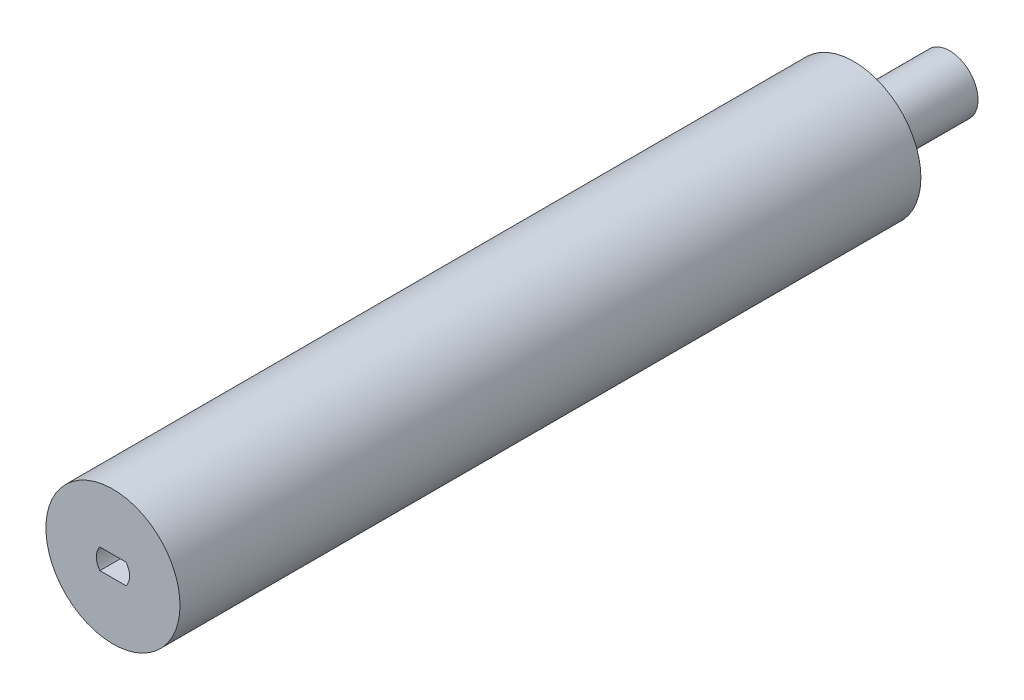
ISO-10303-21;
HEADER;
FILE_DESCRIPTION(('STEP AP214'),'2;1');
FILE_NAME('part.step','',(''),(''),'','','');
FILE_SCHEMA(('AUTOMOTIVE_DESIGN { 1 0 10303 214 1 1 1 1 }'));
ENDSEC;
DATA;
#1=APPLICATION_CONTEXT('core data for automotive mechanical design processes');
#2=APPLICATION_PROTOCOL_DEFINITION('international standard','automotive_design',2000,#1);
#3=PRODUCT_CONTEXT('',#1,'mechanical');
#4=PRODUCT('Part','Part','',(#3));
#5=PRODUCT_RELATED_PRODUCT_CATEGORY('part','',(#4));
#6=PRODUCT_DEFINITION_FORMATION('','',#4);
#7=PRODUCT_DEFINITION_CONTEXT('part definition',#1,'design');
#8=PRODUCT_DEFINITION('design','',#6,#7);
#9=PRODUCT_DEFINITION_SHAPE('','',#8);
#10=(LENGTH_UNIT() NAMED_UNIT(*) SI_UNIT(.MILLI.,.METRE.));
#11=(NAMED_UNIT(*) PLANE_ANGLE_UNIT() SI_UNIT($,.RADIAN.));
#12=(NAMED_UNIT(*) SI_UNIT($,.STERADIAN.) SOLID_ANGLE_UNIT());
#13=UNCERTAINTY_MEASURE_WITH_UNIT(LENGTH_MEASURE(1.E-05),#10,'distance_accuracy_value','');
#14=(GEOMETRIC_REPRESENTATION_CONTEXT(3) GLOBAL_UNCERTAINTY_ASSIGNED_CONTEXT((#13)) GLOBAL_UNIT_ASSIGNED_CONTEXT((#10,
#11,#12)) REPRESENTATION_CONTEXT('',''));
#15=CARTESIAN_POINT('',(0.,0.,0.));
#16=DIRECTION('',(0.,0.,1.));
#17=DIRECTION('',(1.,0.,0.));
#18=AXIS2_PLACEMENT_3D('',#15,#16,#17);
#19=CARTESIAN_POINT('',(0.,0.,-116.));
#20=DIRECTION('',(0.,0.,1.));
#21=DIRECTION('',(1.,0.,0.));
#22=AXIS2_PLACEMENT_3D('',#19,#20,#21);
#23=CYLINDRICAL_SURFACE('',#22,10.5);
#24=CARTESIAN_POINT('',(0.,0.,-116.));
#25=DIRECTION('',(0.,0.,1.));
#26=DIRECTION('',(1.,0.,0.));
#27=AXIS2_PLACEMENT_3D('',#24,#25,#26);
#28=CIRCLE('',#27,10.5);
#29=CARTESIAN_POINT('',(10.5,0.,-116.));
#30=VERTEX_POINT('',#29);
#31=EDGE_CURVE('E48',#30,#30,#28,.T.);
#32=ORIENTED_EDGE('',*,*,#31,.T.);
#33=EDGE_LOOP('',(#32));
#34=FACE_BOUND('',#33,.T.);
#35=CARTESIAN_POINT('',(0.,0.,0.));
#36=DIRECTION('',(0.,0.,1.));
#37=DIRECTION('',(1.,0.,0.));
#38=AXIS2_PLACEMENT_3D('',#35,#36,#37);
#39=CIRCLE('',#38,10.5);
#40=CARTESIAN_POINT('',(10.5,0.,0.));
#41=VERTEX_POINT('',#40);
#42=EDGE_CURVE('E42',#41,#41,#39,.T.);
#43=ORIENTED_EDGE('',*,*,#42,.F.);
#44=EDGE_LOOP('',(#43));
#45=FACE_BOUND('',#44,.T.);
#46=ADVANCED_FACE('F39',(#34,#45),#23,.T.);
#47=CARTESIAN_POINT('',(0.,0.,-116.));
#48=DIRECTION('',(0.,0.,1.));
#49=DIRECTION('',(1.,0.,0.));
#50=AXIS2_PLACEMENT_3D('',#47,#48,#49);
#51=PLANE('',#50);
#52=CARTESIAN_POINT('',(0.,0.,-116.));
#53=DIRECTION('',(0.,0.,-1.));
#54=DIRECTION('',(-1.,0.,0.));
#55=AXIS2_PLACEMENT_3D('',#52,#53,#54);
#56=CIRCLE('',#55,4.45);
#57=CARTESIAN_POINT('',(-4.45,0.,-116.));
#58=VERTEX_POINT('',#57);
#59=EDGE_CURVE('E11',#58,#58,#56,.T.);
#60=ORIENTED_EDGE('',*,*,#59,.F.);
#61=EDGE_LOOP('',(#60));
#62=FACE_BOUND('',#61,.T.);
#63=ORIENTED_EDGE('',*,*,#31,.F.);
#64=EDGE_LOOP('',(#63));
#65=FACE_BOUND('',#64,.T.);
#66=ADVANCED_FACE('F145',(#62,#65),#51,.F.);
#67=CARTESIAN_POINT('',(0.,0.,0.));
#68=DIRECTION('',(0.,0.,1.));
#69=DIRECTION('',(1.,0.,0.));
#70=AXIS2_PLACEMENT_3D('',#67,#68,#69);
#71=PLANE('',#70);
#72=CARTESIAN_POINT('',(0.00171414928473723,0.0325866269007807,0.));
#73=DIRECTION('',(0.,0.,1.));
#74=DIRECTION('',(1.,0.,0.));
#75=AXIS2_PLACEMENT_3D('',#72,#73,#74);
#76=CIRCLE('',#75,2.6);
#77=CARTESIAN_POINT('',(2.05110430247666,-1.56741337309922,0.));
#78=VERTEX_POINT('',#77);
#79=CARTESIAN_POINT('',(2.05110430247666,1.63258662690078,0.));
#80=VERTEX_POINT('',#79);
#81=EDGE_CURVE('E56',#78,#80,#76,.T.);
#82=ORIENTED_EDGE('',*,*,#81,.F.);
#83=DIRECTION('',(1.,0.,0.));
#84=VECTOR('',#83,1.);
#85=CARTESIAN_POINT('',(2.05110430247666,-1.56741337309922,0.));
#86=LINE('',#85,#84);
#87=CARTESIAN_POINT('',(-2.04767600390718,-1.56741337309922,0.));
#88=VERTEX_POINT('',#87);
#89=EDGE_CURVE('E111',#88,#78,#86,.T.);
#90=ORIENTED_EDGE('',*,*,#89,.F.);
#91=CARTESIAN_POINT('',(0.00171414928473723,0.0325866269007807,0.));
#92=DIRECTION('',(0.,0.,1.));
#93=DIRECTION('',(1.,0.,0.));
#94=AXIS2_PLACEMENT_3D('',#91,#92,#93);
#95=CIRCLE('',#94,2.6);
#96=CARTESIAN_POINT('',(-2.04767600390718,1.63258662690078,0.));
#97=VERTEX_POINT('',#96);
#98=EDGE_CURVE('E120',#97,#88,#95,.T.);
#99=ORIENTED_EDGE('',*,*,#98,.F.);
#100=DIRECTION('',(-1.,0.,0.));
#101=VECTOR('',#100,1.);
#102=CARTESIAN_POINT('',(2.05110430247666,1.63258662690078,0.));
#103=LINE('',#102,#101);
#104=EDGE_CURVE('E91',#80,#97,#103,.T.);
#105=ORIENTED_EDGE('',*,*,#104,.F.);
#106=EDGE_LOOP('',(#82,#90,#99,#105));
#107=FACE_BOUND('',#106,.T.);
#108=ORIENTED_EDGE('',*,*,#42,.T.);
#109=EDGE_LOOP('',(#108));
#110=FACE_BOUND('',#109,.T.);
#111=ADVANCED_FACE('F142',(#107,#110),#71,.T.);
#112=CARTESIAN_POINT('',(0.,0.,-131.));
#113=DIRECTION('',(0.,0.,1.));
#114=DIRECTION('',(1.,0.,0.));
#115=AXIS2_PLACEMENT_3D('',#112,#113,#114);
#116=CYLINDRICAL_SURFACE('',#115,4.45);
#117=CARTESIAN_POINT('',(0.,0.,-131.));
#118=DIRECTION('',(0.,0.,-1.));
#119=DIRECTION('',(-1.,0.,0.));
#120=AXIS2_PLACEMENT_3D('',#117,#118,#119);
#121=CIRCLE('',#120,4.45);
#122=CARTESIAN_POINT('',(-4.45,0.,-131.));
#123=VERTEX_POINT('',#122);
#124=EDGE_CURVE('E127',#123,#123,#121,.T.);
#125=ORIENTED_EDGE('',*,*,#124,.F.);
#126=EDGE_LOOP('',(#125));
#127=FACE_BOUND('',#126,.T.);
#128=ORIENTED_EDGE('',*,*,#59,.T.);
#129=EDGE_LOOP('',(#128));
#130=FACE_BOUND('',#129,.T.);
#131=ADVANCED_FACE('F154',(#127,#130),#116,.T.);
#132=CARTESIAN_POINT('',(0.,0.,-131.));
#133=DIRECTION('',(0.,0.,-1.));
#134=DIRECTION('',(-1.,0.,0.));
#135=AXIS2_PLACEMENT_3D('',#132,#133,#134);
#136=PLANE('',#135);
#137=ORIENTED_EDGE('',*,*,#124,.T.);
#138=EDGE_LOOP('',(#137));
#139=FACE_BOUND('',#138,.T.);
#140=ADVANCED_FACE('F161',(#139),#136,.T.);
#141=CARTESIAN_POINT('',(0.00171414928473723,0.0325866269007807,-10.));
#142=DIRECTION('',(0.,0.,1.));
#143=DIRECTION('',(1.,0.,0.));
#144=AXIS2_PLACEMENT_3D('',#141,#142,#143);
#145=CYLINDRICAL_SURFACE('',#144,2.6);
#146=ORIENTED_EDGE('',*,*,#81,.T.);
#147=DIRECTION('',(0.,0.,1.));
#148=VECTOR('',#147,1.);
#149=CARTESIAN_POINT('',(2.05110430247666,1.63258662690078,-10.));
#150=LINE('',#149,#148);
#151=CARTESIAN_POINT('',(2.05110430247666,1.63258662690078,-10.));
#152=VERTEX_POINT('',#151);
#153=EDGE_CURVE('E79',#152,#80,#150,.T.);
#154=ORIENTED_EDGE('',*,*,#153,.F.);
#155=CARTESIAN_POINT('',(0.00171414928473723,0.0325866269007807,-10.));
#156=DIRECTION('',(0.,0.,1.));
#157=DIRECTION('',(1.,0.,0.));
#158=AXIS2_PLACEMENT_3D('',#155,#156,#157);
#159=CIRCLE('',#158,2.6);
#160=CARTESIAN_POINT('',(2.05110430247666,-1.56741337309922,-10.));
#161=VERTEX_POINT('',#160);
#162=EDGE_CURVE('E107',#161,#152,#159,.T.);
#163=ORIENTED_EDGE('',*,*,#162,.F.);
#164=DIRECTION('',(0.,0.,1.));
#165=VECTOR('',#164,1.);
#166=CARTESIAN_POINT('',(2.05110430247666,-1.56741337309922,-10.));
#167=LINE('',#166,#165);
#168=EDGE_CURVE('E64',#161,#78,#167,.T.);
#169=ORIENTED_EDGE('',*,*,#168,.T.);
#170=EDGE_LOOP('',(#146,#154,#163,#169));
#171=FACE_BOUND('',#170,.T.);
#172=ADVANCED_FACE('F165',(#171),#145,.F.);
#173=CARTESIAN_POINT('',(2.05110430247666,-1.56741337309922,-10.));
#174=DIRECTION('',(0.,-1.,0.));
#175=DIRECTION('',(0.,0.,-1.));
#176=AXIS2_PLACEMENT_3D('',#173,#174,#175);
#177=PLANE('',#176);
#178=ORIENTED_EDGE('',*,*,#89,.T.);
#179=ORIENTED_EDGE('',*,*,#168,.F.);
#180=DIRECTION('',(1.,0.,0.));
#181=VECTOR('',#180,1.);
#182=CARTESIAN_POINT('',(2.05110430247666,-1.56741337309922,-10.));
#183=LINE('',#182,#181);
#184=CARTESIAN_POINT('',(-2.04767600390718,-1.56741337309922,-10.));
#185=VERTEX_POINT('',#184);
#186=EDGE_CURVE('E104',#185,#161,#183,.T.);
#187=ORIENTED_EDGE('',*,*,#186,.F.);
#188=DIRECTION('',(0.,0.,1.));
#189=VECTOR('',#188,1.);
#190=CARTESIAN_POINT('',(-2.04767600390718,-1.56741337309922,-10.));
#191=LINE('',#190,#189);
#192=EDGE_CURVE('E96',#185,#88,#191,.T.);
#193=ORIENTED_EDGE('',*,*,#192,.T.);
#194=EDGE_LOOP('',(#178,#179,#187,#193));
#195=FACE_BOUND('',#194,.T.);
#196=ADVANCED_FACE('F169',(#195),#177,.F.);
#197=CARTESIAN_POINT('',(0.00171414928473723,0.0325866269007807,-10.));
#198=DIRECTION('',(0.,0.,1.));
#199=DIRECTION('',(1.,0.,0.));
#200=AXIS2_PLACEMENT_3D('',#197,#198,#199);
#201=CYLINDRICAL_SURFACE('',#200,2.6);
#202=ORIENTED_EDGE('',*,*,#98,.T.);
#203=ORIENTED_EDGE('',*,*,#192,.F.);
#204=CARTESIAN_POINT('',(0.00171414928473723,0.0325866269007807,-10.));
#205=DIRECTION('',(0.,0.,1.));
#206=DIRECTION('',(1.,0.,0.));
#207=AXIS2_PLACEMENT_3D('',#204,#205,#206);
#208=CIRCLE('',#207,2.6);
#209=CARTESIAN_POINT('',(-2.04767600390718,1.63258662690078,-10.));
#210=VERTEX_POINT('',#209);
#211=EDGE_CURVE('E99',#210,#185,#208,.T.);
#212=ORIENTED_EDGE('',*,*,#211,.F.);
#213=DIRECTION('',(0.,0.,1.));
#214=VECTOR('',#213,1.);
#215=CARTESIAN_POINT('',(-2.04767600390718,1.63258662690078,-10.));
#216=LINE('',#215,#214);
#217=EDGE_CURVE('E84',#210,#97,#216,.T.);
#218=ORIENTED_EDGE('',*,*,#217,.T.);
#219=EDGE_LOOP('',(#202,#203,#212,#218));
#220=FACE_BOUND('',#219,.T.);
#221=ADVANCED_FACE('F100',(#220),#201,.F.);
#222=CARTESIAN_POINT('',(2.05110430247666,1.63258662690078,-10.));
#223=DIRECTION('',(0.,1.,0.));
#224=DIRECTION('',(0.,0.,1.));
#225=AXIS2_PLACEMENT_3D('',#222,#223,#224);
#226=PLANE('',#225);
#227=ORIENTED_EDGE('',*,*,#104,.T.);
#228=ORIENTED_EDGE('',*,*,#217,.F.);
#229=DIRECTION('',(-1.,0.,0.));
#230=VECTOR('',#229,1.);
#231=CARTESIAN_POINT('',(2.05110430247666,1.63258662690078,-10.));
#232=LINE('',#231,#230);
#233=EDGE_CURVE('E88',#152,#210,#232,.T.);
#234=ORIENTED_EDGE('',*,*,#233,.F.);
#235=ORIENTED_EDGE('',*,*,#153,.T.);
#236=EDGE_LOOP('',(#227,#228,#234,#235));
#237=FACE_BOUND('',#236,.T.);
#238=ADVANCED_FACE('F86',(#237),#226,.F.);
#239=CARTESIAN_POINT('',(0.00171414928473723,0.0325866269007807,-10.));
#240=DIRECTION('',(0.,0.,1.));
#241=DIRECTION('',(1.,0.,0.));
#242=AXIS2_PLACEMENT_3D('',#239,#240,#241);
#243=PLANE('',#242);
#244=ORIENTED_EDGE('',*,*,#162,.T.);
#245=ORIENTED_EDGE('',*,*,#233,.T.);
#246=ORIENTED_EDGE('',*,*,#211,.T.);
#247=ORIENTED_EDGE('',*,*,#186,.T.);
#248=EDGE_LOOP('',(#244,#245,#246,#247));
#249=FACE_BOUND('',#248,.T.);
#250=ADVANCED_FACE('F106',(#249),#243,.T.);
#251=CLOSED_SHELL('',(#46,#66,#111,#131,#140,#172,#196,#221,#238,#250));
#252=MANIFOLD_SOLID_BREP('B2',#251);
#253=ADVANCED_BREP_SHAPE_REPRESENTATION('',(#18,#252),#14);
#254=SHAPE_DEFINITION_REPRESENTATION(#9,#253);
ENDSEC;
END-ISO-10303-21;
